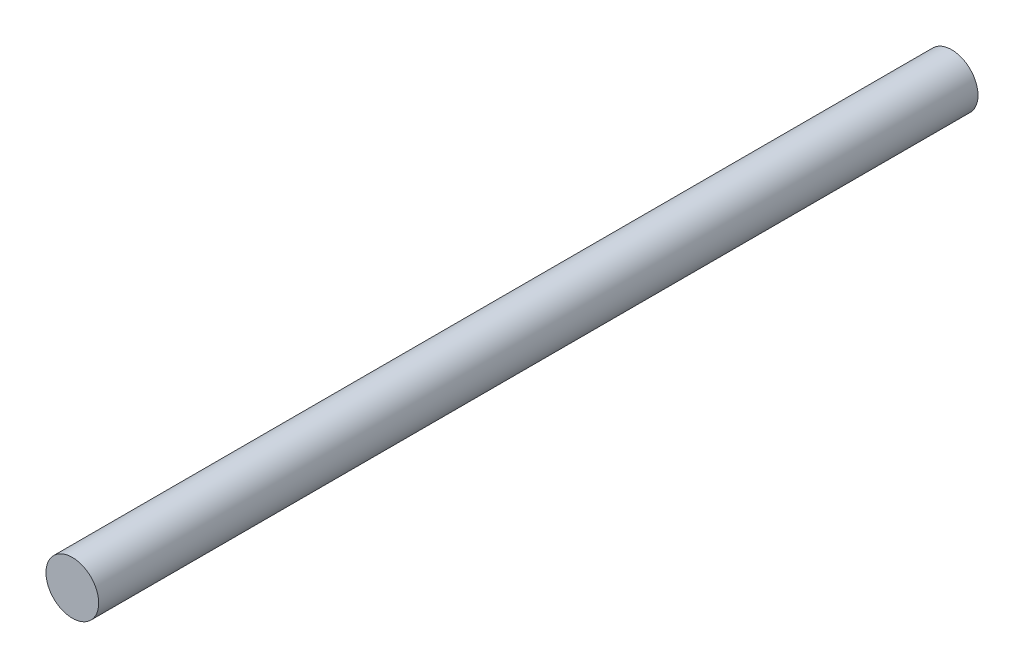
ISO-10303-21;
HEADER;
FILE_DESCRIPTION(('STEP AP214'),'2;1');
FILE_NAME('part.step','',(''),(''),'','','');
FILE_SCHEMA(('AUTOMOTIVE_DESIGN { 1 0 10303 214 1 1 1 1 }'));
ENDSEC;
DATA;
#1=APPLICATION_CONTEXT('core data for automotive mechanical design processes');
#2=APPLICATION_PROTOCOL_DEFINITION('international standard','automotive_design',2000,#1);
#3=PRODUCT_CONTEXT('',#1,'mechanical');
#4=PRODUCT('Part','Part','',(#3));
#5=PRODUCT_RELATED_PRODUCT_CATEGORY('part','',(#4));
#6=PRODUCT_DEFINITION_FORMATION('','',#4);
#7=PRODUCT_DEFINITION_CONTEXT('part definition',#1,'design');
#8=PRODUCT_DEFINITION('design','',#6,#7);
#9=PRODUCT_DEFINITION_SHAPE('','',#8);
#10=(LENGTH_UNIT() NAMED_UNIT(*) SI_UNIT(.MILLI.,.METRE.));
#11=(NAMED_UNIT(*) PLANE_ANGLE_UNIT() SI_UNIT($,.RADIAN.));
#12=(NAMED_UNIT(*) SI_UNIT($,.STERADIAN.) SOLID_ANGLE_UNIT());
#13=UNCERTAINTY_MEASURE_WITH_UNIT(LENGTH_MEASURE(1.E-05),#10,'distance_accuracy_value','');
#14=(GEOMETRIC_REPRESENTATION_CONTEXT(3) GLOBAL_UNCERTAINTY_ASSIGNED_CONTEXT((#13)) GLOBAL_UNIT_ASSIGNED_CONTEXT((#10,
#11,#12)) REPRESENTATION_CONTEXT('',''));
#15=CARTESIAN_POINT('',(0.,0.,0.));
#16=DIRECTION('',(0.,0.,1.));
#17=DIRECTION('',(1.,0.,0.));
#18=AXIS2_PLACEMENT_3D('',#15,#16,#17);
#19=CARTESIAN_POINT('',(0.,0.,1031.25));
#20=DIRECTION('',(0.,0.,-1.));
#21=DIRECTION('',(-1.,0.,0.));
#22=AXIS2_PLACEMENT_3D('',#19,#20,#21);
#23=CYLINDRICAL_SURFACE('',#22,56.25);
#24=CARTESIAN_POINT('',(0.,0.,1031.25));
#25=DIRECTION('',(0.,0.,1.));
#26=DIRECTION('',(1.,0.,0.));
#27=AXIS2_PLACEMENT_3D('',#24,#25,#26);
#28=CIRCLE('',#27,56.25);
#29=CARTESIAN_POINT('',(56.25,0.,1031.25));
#30=VERTEX_POINT('',#29);
#31=EDGE_CURVE('E10',#30,#30,#28,.T.);
#32=ORIENTED_EDGE('',*,*,#31,.F.);
#33=EDGE_LOOP('',(#32));
#34=FACE_BOUND('',#33,.T.);
#35=CARTESIAN_POINT('',(0.,0.,-843.75));
#36=DIRECTION('',(0.,0.,1.));
#37=DIRECTION('',(1.,0.,0.));
#38=AXIS2_PLACEMENT_3D('',#35,#36,#37);
#39=CIRCLE('',#38,56.25);
#40=CARTESIAN_POINT('',(56.25,0.,-843.75));
#41=VERTEX_POINT('',#40);
#42=EDGE_CURVE('E37',#41,#41,#39,.T.);
#43=ORIENTED_EDGE('',*,*,#42,.T.);
#44=EDGE_LOOP('',(#43));
#45=FACE_BOUND('',#44,.T.);
#46=ADVANCED_FACE('F34',(#34,#45),#23,.T.);
#47=CARTESIAN_POINT('',(0.,0.,1031.25));
#48=DIRECTION('',(0.,0.,1.));
#49=DIRECTION('',(1.,0.,0.));
#50=AXIS2_PLACEMENT_3D('',#47,#48,#49);
#51=PLANE('',#50);
#52=ORIENTED_EDGE('',*,*,#31,.T.);
#53=EDGE_LOOP('',(#52));
#54=FACE_BOUND('',#53,.T.);
#55=ADVANCED_FACE('F49',(#54),#51,.T.);
#56=CARTESIAN_POINT('',(0.,0.,-843.75));
#57=DIRECTION('',(0.,0.,1.));
#58=DIRECTION('',(1.,0.,0.));
#59=AXIS2_PLACEMENT_3D('',#56,#57,#58);
#60=PLANE('',#59);
#61=ORIENTED_EDGE('',*,*,#42,.F.);
#62=EDGE_LOOP('',(#61));
#63=FACE_BOUND('',#62,.T.);
#64=ADVANCED_FACE('F47',(#63),#60,.F.);
#65=CLOSED_SHELL('',(#46,#55,#64));
#66=MANIFOLD_SOLID_BREP('B2',#65);
#67=ADVANCED_BREP_SHAPE_REPRESENTATION('',(#18,#66),#14);
#68=SHAPE_DEFINITION_REPRESENTATION(#9,#67);
ENDSEC;
END-ISO-10303-21;
